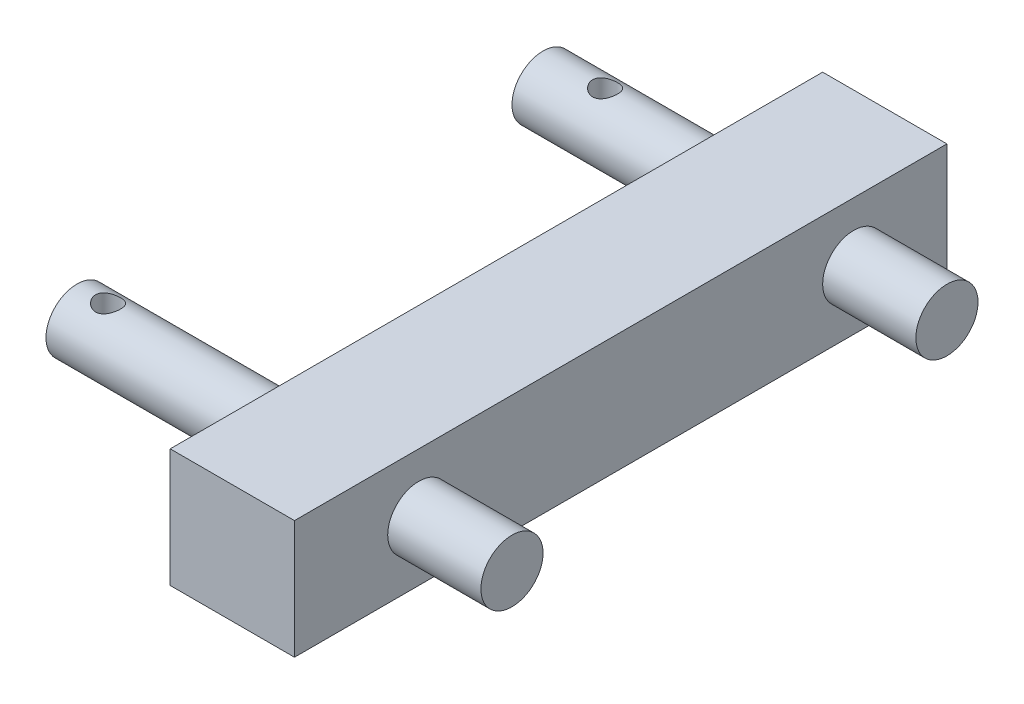
ISO-10303-21;
HEADER;
FILE_DESCRIPTION(('STEP AP214'),'2;1');
FILE_NAME('part.step','',(''),(''),'','','');
FILE_SCHEMA(('AUTOMOTIVE_DESIGN { 1 0 10303 214 1 1 1 1 }'));
ENDSEC;
DATA;
#1=APPLICATION_CONTEXT('core data for automotive mechanical design processes');
#2=APPLICATION_PROTOCOL_DEFINITION('international standard','automotive_design',2000,#1);
#3=PRODUCT_CONTEXT('',#1,'mechanical');
#4=PRODUCT('Part','Part','',(#3));
#5=PRODUCT_RELATED_PRODUCT_CATEGORY('part','',(#4));
#6=PRODUCT_DEFINITION_FORMATION('','',#4);
#7=PRODUCT_DEFINITION_CONTEXT('part definition',#1,'design');
#8=PRODUCT_DEFINITION('design','',#6,#7);
#9=PRODUCT_DEFINITION_SHAPE('','',#8);
#10=(LENGTH_UNIT() NAMED_UNIT(*) SI_UNIT(.MILLI.,.METRE.));
#11=(NAMED_UNIT(*) PLANE_ANGLE_UNIT() SI_UNIT($,.RADIAN.));
#12=(NAMED_UNIT(*) SI_UNIT($,.STERADIAN.) SOLID_ANGLE_UNIT());
#13=UNCERTAINTY_MEASURE_WITH_UNIT(LENGTH_MEASURE(1.E-05),#10,'distance_accuracy_value','');
#14=(GEOMETRIC_REPRESENTATION_CONTEXT(3) GLOBAL_UNCERTAINTY_ASSIGNED_CONTEXT((#13)) GLOBAL_UNIT_ASSIGNED_CONTEXT((#10,
#11,#12)) REPRESENTATION_CONTEXT('',''));
#15=CARTESIAN_POINT('',(0.,0.,0.));
#16=DIRECTION('',(0.,0.,1.));
#17=DIRECTION('',(1.,0.,0.));
#18=AXIS2_PLACEMENT_3D('',#15,#16,#17);
#19=CARTESIAN_POINT('',(-60.,75.8275362318841,-30.));
#20=DIRECTION('',(1.,0.,0.));
#21=DIRECTION('',(0.,0.,-1.));
#22=AXIS2_PLACEMENT_3D('',#19,#20,#21);
#23=CYLINDRICAL_SURFACE('',#22,9.99999999999995);
#24=CARTESIAN_POINT('',(-40.,66.6623848419724,-34.));
#25=CARTESIAN_POINT('',(-39.8928225032156,66.6623840246591,-33.9999991799669));
#26=CARTESIAN_POINT('',(-39.7856121402052,66.6604984048382,-33.9956862757883));
#27=CARTESIAN_POINT('',(-39.5719679058293,66.6530173260714,-33.9784780450432));
#28=CARTESIAN_POINT('',(-39.4655345500547,66.6474195964997,-33.965577465543));
#29=CARTESIAN_POINT('',(-39.2540640466445,66.6326854457234,-33.9312935770878));
#30=CARTESIAN_POINT('',(-39.1490301151513,66.6235419734008,-33.9098933635657));
#31=CARTESIAN_POINT('',(-38.9413124028102,66.6020217699015,-33.8588393720858));
#32=CARTESIAN_POINT('',(-38.8386296168982,66.589643696467,-33.8291821674013));
#33=CARTESIAN_POINT('',(-38.5360102733714,66.5483339170078,-33.7284997845045));
#34=CARTESIAN_POINT('',(-38.3404620790357,66.5151481299489,-33.6455922809956));
#35=CARTESIAN_POINT('',(-37.966198731327,66.4412411051698,-33.4508325645389));
#36=CARTESIAN_POINT('',(-37.7874799141088,66.4005215133488,-33.3389866715961));
#37=CARTESIAN_POINT('',(-37.4414881863986,66.3135194572749,-33.082646249532));
#38=CARTESIAN_POINT('',(-37.275289566711,66.2670580139639,-32.9367593327215));
#39=CARTESIAN_POINT('',(-36.9689395919581,66.1752869510039,-32.6194175940661));
#40=CARTESIAN_POINT('',(-36.828797339245,66.1299777386209,-32.4479538749543));
#41=CARTESIAN_POINT('',(-36.5731878901629,66.0434681138024,-32.0760127957501));
#42=CARTESIAN_POINT('',(-36.4589115800306,66.0025001689256,-31.8746579780387));
#43=CARTESIAN_POINT('',(-36.266312680323,65.9314576685446,-31.4536505989552));
#44=CARTESIAN_POINT('',(-36.1879754605667,65.9013786813879,-31.2340055263283));
#45=CARTESIAN_POINT('',(-36.073317072677,65.8567697343855,-30.7939328653324));
#46=CARTESIAN_POINT('',(-36.0351453840019,65.8415574970902,-30.5740579727255));
#47=CARTESIAN_POINT('',(-35.9959430164992,65.8259300175171,-30.1305326541602));
#48=CARTESIAN_POINT('',(-35.9948984849555,65.8255092563117,-29.9068836675369));
#49=CARTESIAN_POINT('',(-36.0289655425464,65.839096975624,-29.4755350113361));
#50=CARTESIAN_POINT('',(-36.0620495462971,65.8522962964952,-29.2676450944575));
#51=CARTESIAN_POINT('',(-36.1599857518182,65.8905504024605,-28.8606537813577));
#52=CARTESIAN_POINT('',(-36.2248402845843,65.9156060574463,-28.661553031164));
#53=CARTESIAN_POINT('',(-36.3852729659723,65.9755997427459,-28.2742041230333));
#54=CARTESIAN_POINT('',(-36.4812994296887,66.0106810225626,-28.0861647532568));
#55=CARTESIAN_POINT('',(-36.7009300137803,66.0872445282756,-27.7283836985028));
#56=CARTESIAN_POINT('',(-36.8245435861843,66.1287289465403,-27.55864831456));
#57=CARTESIAN_POINT('',(-37.1052982719048,66.2171034883625,-27.2304623440239));
#58=CARTESIAN_POINT('',(-37.2641077851502,66.2641697016492,-27.0734843094685));
#59=CARTESIAN_POINT('',(-37.6059811436594,66.3563030124186,-26.7877851692135));
#60=CARTESIAN_POINT('',(-37.78905289639,66.4013694517225,-26.6590733124257));
#61=CARTESIAN_POINT('',(-38.1808380447491,66.4855982837037,-26.4301916225618));
#62=CARTESIAN_POINT('',(-38.3901296606776,66.52455795073,-26.3309306967276));
#63=CARTESIAN_POINT('',(-38.8244309806241,66.5897844250024,-26.169647480267));
#64=CARTESIAN_POINT('',(-39.0494303694531,66.6160594740579,-26.107601003244));
#65=CARTESIAN_POINT('',(-39.4940715549349,66.6509410378298,-26.0260901022902));
#66=CARTESIAN_POINT('',(-39.7132008942571,66.6605289027613,-26.0042558063709));
#67=CARTESIAN_POINT('',(-40.1521544155191,66.6637462745034,-25.9968773471142));
#68=CARTESIAN_POINT('',(-40.3719783665513,66.6573806206769,-26.0113221788174));
#69=CARTESIAN_POINT('',(-40.7929178699139,66.6304153447018,-26.0739342104199));
#70=CARTESIAN_POINT('',(-40.9943858748,66.6106470759181,-26.1201338759523));
#71=CARTESIAN_POINT('',(-41.386576809571,66.5601352113373,-26.2423916261782));
#72=CARTESIAN_POINT('',(-41.5772973462148,66.5293891821122,-26.3184563313954));
#73=CARTESIAN_POINT('',(-41.9512047155908,66.4588605946821,-26.5017287210369));
#74=CARTESIAN_POINT('',(-42.1337723773872,66.4187621391005,-26.6100742634708));
#75=CARTESIAN_POINT('',(-42.478965974885,66.3345285287282,-26.8536695511162));
#76=CARTESIAN_POINT('',(-42.6415837455978,66.2903917339633,-26.9889302530356));
#77=CARTESIAN_POINT('',(-42.9547468171913,66.1991179124557,-27.2943115766394));
#78=CARTESIAN_POINT('',(-43.1035131305545,66.1520000861791,-27.4662691411114));
#79=CARTESIAN_POINT('',(-43.3703541532482,66.0631403405339,-27.8338327332606));
#80=CARTESIAN_POINT('',(-43.4884276132975,66.0213986400229,-28.0294397230581));
#81=CARTESIAN_POINT('',(-43.6900952528195,65.9478619138748,-28.4394401320027));
#82=CARTESIAN_POINT('',(-43.7736976879472,65.9160645070653,-28.653829038035));
#83=CARTESIAN_POINT('',(-43.9030977051994,65.8660819625116,-29.0952128181384));
#84=CARTESIAN_POINT('',(-43.9489158043134,65.8478894377829,-29.3222007793252));
#85=CARTESIAN_POINT('',(-43.999009401911,65.8279560676274,-29.766366979388));
#86=CARTESIAN_POINT('',(-44.0058002520768,65.8252192968186,-29.9832190151057));
#87=CARTESIAN_POINT('',(-43.9842890462796,65.8338153844803,-30.4148676711747));
#88=CARTESIAN_POINT('',(-43.9559923024791,65.8451461131716,-30.6296645977029));
#89=CARTESIAN_POINT('',(-43.8669064057872,65.8801059639925,-31.0443418049458));
#90=CARTESIAN_POINT('',(-43.807142043495,65.9033466169667,-31.2444776131699));
#91=CARTESIAN_POINT('',(-43.6578944552422,65.9596372774745,-31.631844705644));
#92=CARTESIAN_POINT('',(-43.568405747944,65.9926890941227,-31.8190736020911));
#93=CARTESIAN_POINT('',(-43.3577933524316,66.0671743359965,-32.1844060987939));
#94=CARTESIAN_POINT('',(-43.2354464559039,66.1089136042386,-32.3617408310488));
#95=CARTESIAN_POINT('',(-42.9644239163639,66.1957482012498,-32.6941079995884));
#96=CARTESIAN_POINT('',(-42.8157373759609,66.2408449145864,-32.849131156699));
#97=CARTESIAN_POINT('',(-42.4853657611342,66.3327808293249,-33.1424027582614));
#98=CARTESIAN_POINT('',(-42.302207701298,66.379555075347,-33.2790186502017));
#99=CARTESIAN_POINT('',(-41.9141302787523,66.4665433068692,-33.5196940249722));
#100=CARTESIAN_POINT('',(-41.7092083613338,66.5067565208067,-33.6237496801108));
#101=CARTESIAN_POINT('',(-41.3018760562205,66.5723572254604,-33.7879851569083));
#102=CARTESIAN_POINT('',(-41.1008923240542,66.5987517169381,-33.8512656934687));
#103=CARTESIAN_POINT('',(-40.7933610402093,66.6286805734502,-33.9219463210498));
#104=CARTESIAN_POINT('',(-40.6899269641056,66.6370435255464,-33.9414605214492));
#105=CARTESIAN_POINT('',(-40.4816430703891,66.650324228468,-33.9722885067968));
#106=CARTESIAN_POINT('',(-40.3767941106041,66.6552439789524,-33.9836070515516));
#107=CARTESIAN_POINT('',(-40.2264494086476,66.65969947765,-33.9938423210329));
#108=CARTESIAN_POINT('',(-40.1812001696778,66.66070563373,-33.9961505841499));
#109=CARTESIAN_POINT('',(-40.0906359157854,66.6620485132363,-33.9992296533752));
#110=CARTESIAN_POINT('',(-40.0453208962838,66.6623851875802,-34.0000003467579));
#111=CARTESIAN_POINT('',(-40.,66.6623848419724,-34.));
#112=B_SPLINE_CURVE_WITH_KNOTS('',3,(#24,#25,#26,#27,#28,#29,#30,#31,#32,#33,#34,#35,#36,#37,
#38,#39,#40,#41,#42,#43,#44,#45,#46,#47,#48,#49,#50,#51,#52,#53,#54,#55,#56,#57,#58,#59,#60,#61,
#62,#63,#64,#65,#66,#67,#68,#69,#70,#71,#72,#73,#74,#75,#76,#77,#78,#79,#80,#81,#82,#83,#84,#85,
#86,#87,#88,#89,#90,#91,#92,#93,#94,#95,#96,#97,#98,#99,#100,#101,#102,#103,#104,#105,#106,#107,
#108,#109,#110,#111),.UNSPECIFIED.,.T.,.F.,(4,2,2,2,2,2,2,2,2,2,2,2,2,2,2,2,2,2,2,2,2,2,2,2,2,2,
2,2,2,2,2,2,2,2,2,2,2,2,2,2,2,2,2,4),(0.,0.321486083338399,0.643168995111199,0.96549491827271,
1.28795480954363,1.92974178448592,2.57138871437637,3.24631250358765,3.921471624866,
4.62325351972773,5.32474947728876,5.99228379564283,6.6595690440126,7.28937303450521,
7.91922324048035,8.55856614259712,9.19812843669979,9.87968101952628,10.5614562804417,
11.2624893122443,11.9630662339012,12.6208430883876,13.278420436058,13.8985450996021,
14.5188073109319,15.1642232309532,15.8099024284162,16.5032748228388,17.1966754349541,
17.8899098841554,18.5827676569819,19.2304209330182,19.8779761681512,20.5056400267662,
21.1334196944709,21.7889411606977,22.4447344691833,23.1411252036115,23.837597773083,
24.4715333542807,24.7879924179097,25.104267543275,25.2402006430821,25.3761437083412),.UNSPECIFIED.);
#113=CARTESIAN_POINT('',(-40.,66.6623848419724,-34.));
#114=VERTEX_POINT('',#113);
#115=EDGE_CURVE('E360',#114,#114,#112,.T.);
#116=ORIENTED_EDGE('',*,*,#115,.F.);
#117=EDGE_LOOP('',(#116));
#118=FACE_BOUND('',#117,.T.);
#119=CARTESIAN_POINT('',(0.,75.8275362318841,-30.));
#120=DIRECTION('',(-1.,0.,0.));
#121=DIRECTION('',(0.,0.,1.));
#122=AXIS2_PLACEMENT_3D('',#119,#120,#121);
#123=CIRCLE('',#122,9.99999999999995);
#124=CARTESIAN_POINT('',(0.,75.8275362318841,-20.0000000000001));
#125=VERTEX_POINT('',#124);
#126=EDGE_CURVE('E11',#125,#125,#123,.T.);
#127=ORIENTED_EDGE('',*,*,#126,.T.);
#128=EDGE_LOOP('',(#127));
#129=FACE_BOUND('',#128,.T.);
#130=CARTESIAN_POINT('',(-60.,75.8275362318841,-30.));
#131=DIRECTION('',(1.,0.,0.));
#132=DIRECTION('',(0.,0.,-1.));
#133=AXIS2_PLACEMENT_3D('',#130,#131,#132);
#134=CIRCLE('',#133,9.99999999999995);
#135=CARTESIAN_POINT('',(-60.,75.8275362318841,-39.9999999999999));
#136=VERTEX_POINT('',#135);
#137=EDGE_CURVE('E177',#136,#136,#134,.T.);
#138=ORIENTED_EDGE('',*,*,#137,.T.);
#139=EDGE_LOOP('',(#138));
#140=FACE_BOUND('',#139,.T.);
#141=CARTESIAN_POINT('',(-40.,84.9926876217957,-34.));
#142=CARTESIAN_POINT('',(-40.1071774967844,84.992688439109,-33.9999991799669));
#143=CARTESIAN_POINT('',(-40.2143878597948,84.9945740589299,-33.9956862757883));
#144=CARTESIAN_POINT('',(-40.4280320941707,85.0020551376967,-33.9784780450432));
#145=CARTESIAN_POINT('',(-40.5344654499453,85.0076528672684,-33.965577465543));
#146=CARTESIAN_POINT('',(-40.7459359533555,85.0223870180447,-33.9312935770878));
#147=CARTESIAN_POINT('',(-40.8509698848487,85.0315304903673,-33.9098933635657));
#148=CARTESIAN_POINT('',(-41.0586875971898,85.0530506938666,-33.8588393720858));
#149=CARTESIAN_POINT('',(-41.1613703831018,85.0654287673011,-33.8291821674013));
#150=CARTESIAN_POINT('',(-41.4639897266286,85.1067385467603,-33.7284997845045));
#151=CARTESIAN_POINT('',(-41.6595379209643,85.1399243338192,-33.6455922809956));
#152=CARTESIAN_POINT('',(-42.033801268673,85.2138313585984,-33.4508325645389));
#153=CARTESIAN_POINT('',(-42.2125200858912,85.2545509504193,-33.3389866715961));
#154=CARTESIAN_POINT('',(-42.5585118136014,85.3415530064933,-33.082646249532));
#155=CARTESIAN_POINT('',(-42.724710433289,85.3880144498042,-32.9367593327215));
#156=CARTESIAN_POINT('',(-43.0310604080419,85.4797855127642,-32.6194175940661));
#157=CARTESIAN_POINT('',(-43.171202660755,85.5250947251473,-32.4479538749543));
#158=CARTESIAN_POINT('',(-43.4268121098371,85.6116043499657,-32.0760127957501));
#159=CARTESIAN_POINT('',(-43.5410884199694,85.6525722948425,-31.8746579780387));
#160=CARTESIAN_POINT('',(-43.733687319677,85.7236147952235,-31.4536505989552));
#161=CARTESIAN_POINT('',(-43.8120245394333,85.7536937823802,-31.2340055263283));
#162=CARTESIAN_POINT('',(-43.926682927323,85.7983027293826,-30.7939328653324));
#163=CARTESIAN_POINT('',(-43.9648546159981,85.8135149666779,-30.5740579727255));
#164=CARTESIAN_POINT('',(-44.0040569835008,85.829142446251,-30.1305326541602));
#165=CARTESIAN_POINT('',(-44.0051015150445,85.8295632074564,-29.9068836675369));
#166=CARTESIAN_POINT('',(-43.9710344574536,85.8159754881441,-29.4755350113361));
#167=CARTESIAN_POINT('',(-43.9379504537029,85.8027761672729,-29.2676450944575));
#168=CARTESIAN_POINT('',(-43.8400142481818,85.7645220613076,-28.8606537813577));
#169=CARTESIAN_POINT('',(-43.7751597154157,85.7394664063218,-28.661553031164));
#170=CARTESIAN_POINT('',(-43.6147270340277,85.6794727210222,-28.2742041230333));
#171=CARTESIAN_POINT('',(-43.5187005703113,85.6443914412055,-28.0861647532568));
#172=CARTESIAN_POINT('',(-43.2990699862197,85.5678279354925,-27.7283836985028));
#173=CARTESIAN_POINT('',(-43.1754564138157,85.5263435172278,-27.55864831456));
#174=CARTESIAN_POINT('',(-42.8947017280952,85.4379689754056,-27.2304623440239));
#175=CARTESIAN_POINT('',(-42.7358922148498,85.3909027621189,-27.0734843094685));
#176=CARTESIAN_POINT('',(-42.3940188563406,85.2987694513495,-26.7877851692135));
#177=CARTESIAN_POINT('',(-42.2109471036101,85.2537030120456,-26.6590733124257));
#178=CARTESIAN_POINT('',(-41.8191619552509,85.1694741800644,-26.4301916225618));
#179=CARTESIAN_POINT('',(-41.6098703393224,85.1305145130381,-26.3309306967276));
#180=CARTESIAN_POINT('',(-41.1755690193759,85.0652880387657,-26.169647480267));
#181=CARTESIAN_POINT('',(-40.9505696305469,85.0390129897102,-26.107601003244));
#182=CARTESIAN_POINT('',(-40.5059284450651,85.0041314259383,-26.0260901022902));
#183=CARTESIAN_POINT('',(-40.2867991057429,84.9945435610068,-26.0042558063709));
#184=CARTESIAN_POINT('',(-39.8478455844809,84.9913261892648,-25.9968773471142));
#185=CARTESIAN_POINT('',(-39.6280216334487,84.9976918430912,-26.0113221788174));
#186=CARTESIAN_POINT('',(-39.2070821300862,85.0246571190663,-26.0739342104199));
#187=CARTESIAN_POINT('',(-39.0056141252,85.04442538785,-26.1201338759523));
#188=CARTESIAN_POINT('',(-38.613423190429,85.0949372524308,-26.2423916261782));
#189=CARTESIAN_POINT('',(-38.4227026537852,85.1256832816559,-26.3184563313954));
#190=CARTESIAN_POINT('',(-38.0487952844092,85.196211869086,-26.5017287210369));
#191=CARTESIAN_POINT('',(-37.8662276226128,85.2363103246676,-26.6100742634708));
#192=CARTESIAN_POINT('',(-37.521034025115,85.3205439350399,-26.8536695511162));
#193=CARTESIAN_POINT('',(-37.3584162544022,85.3646807298048,-26.9889302530356));
#194=CARTESIAN_POINT('',(-37.0452531828087,85.4559545513124,-27.2943115766394));
#195=CARTESIAN_POINT('',(-36.8964868694455,85.5030723775891,-27.4662691411114));
#196=CARTESIAN_POINT('',(-36.6296458467518,85.5919321232342,-27.8338327332606));
#197=CARTESIAN_POINT('',(-36.5115723867025,85.6336738237452,-28.0294397230581));
#198=CARTESIAN_POINT('',(-36.3099047471805,85.7072105498933,-28.4394401320027));
#199=CARTESIAN_POINT('',(-36.2263023120528,85.7390079567028,-28.653829038035));
#200=CARTESIAN_POINT('',(-36.0969022948006,85.7889905012565,-29.0952128181384));
#201=CARTESIAN_POINT('',(-36.0510841956866,85.8071830259852,-29.3222007793252));
#202=CARTESIAN_POINT('',(-36.000990598089,85.8271163961407,-29.766366979388));
#203=CARTESIAN_POINT('',(-35.9941997479232,85.8298531669495,-29.9832190151057));
#204=CARTESIAN_POINT('',(-36.0157109537204,85.8212570792878,-30.4148676711747));
#205=CARTESIAN_POINT('',(-36.0440076975209,85.8099263505965,-30.6296645977029));
#206=CARTESIAN_POINT('',(-36.1330935942128,85.7749664997756,-31.0443418049458));
#207=CARTESIAN_POINT('',(-36.192857956505,85.7517258468014,-31.2444776131699));
#208=CARTESIAN_POINT('',(-36.3421055447578,85.6954351862936,-31.631844705644));
#209=CARTESIAN_POINT('',(-36.431594252056,85.6623833696454,-31.8190736020911));
#210=CARTESIAN_POINT('',(-36.6422066475684,85.5878981277716,-32.1844060987939));
#211=CARTESIAN_POINT('',(-36.7645535440961,85.5461588595295,-32.3617408310488));
#212=CARTESIAN_POINT('',(-37.0355760836361,85.4593242625183,-32.6941079995884));
#213=CARTESIAN_POINT('',(-37.1842626240391,85.4142275491817,-32.849131156699));
#214=CARTESIAN_POINT('',(-37.5146342388658,85.3222916344432,-33.1424027582614));
#215=CARTESIAN_POINT('',(-37.697792298702,85.2755173884211,-33.2790186502017));
#216=CARTESIAN_POINT('',(-38.0858697212476,85.1885291568989,-33.5196940249722));
#217=CARTESIAN_POINT('',(-38.2907916386662,85.1483159429614,-33.6237496801108));
#218=CARTESIAN_POINT('',(-38.6981239437795,85.0827152383077,-33.7879851569083));
#219=CARTESIAN_POINT('',(-38.8991076759458,85.05632074683,-33.8512656934687));
#220=CARTESIAN_POINT('',(-39.2066389597907,85.0263918903179,-33.9219463210498));
#221=CARTESIAN_POINT('',(-39.3100730358944,85.0180289382217,-33.9414605214492));
#222=CARTESIAN_POINT('',(-39.5183569296109,85.0047482353001,-33.9722885067968));
#223=CARTESIAN_POINT('',(-39.6232058893959,84.9998284848157,-33.9836070515516));
#224=CARTESIAN_POINT('',(-39.7735505913524,84.9953729861182,-33.9938423210329));
#225=CARTESIAN_POINT('',(-39.8187998303222,84.9943668300381,-33.9961505841499));
#226=CARTESIAN_POINT('',(-39.9093640842146,84.9930239505318,-33.9992296533752));
#227=CARTESIAN_POINT('',(-39.9546791037162,84.9926872761879,-34.0000003467579));
#228=CARTESIAN_POINT('',(-40.,84.9926876217957,-34.));
#229=B_SPLINE_CURVE_WITH_KNOTS('',3,(#141,#142,#143,#144,#145,#146,#147,#148,#149,#150,#151,
#152,#153,#154,#155,#156,#157,#158,#159,#160,#161,#162,#163,#164,#165,#166,#167,#168,#169,#170,
#171,#172,#173,#174,#175,#176,#177,#178,#179,#180,#181,#182,#183,#184,#185,#186,#187,#188,#189,
#190,#191,#192,#193,#194,#195,#196,#197,#198,#199,#200,#201,#202,#203,#204,#205,#206,#207,#208,
#209,#210,#211,#212,#213,#214,#215,#216,#217,#218,#219,#220,#221,#222,#223,#224,#225,#226,#227,
#228),.UNSPECIFIED.,.T.,.F.,(4,2,2,2,2,2,2,2,2,2,2,2,2,2,2,2,2,2,2,2,2,2,2,2,2,2,2,2,2,2,2,2,2,
2,2,2,2,2,2,2,2,2,2,4),(0.,0.321486083338407,0.643168995111198,0.965494918272709,
1.28795480954363,1.92974178448592,2.57138871437637,3.24631250358765,3.921471624866,
4.62325351972773,5.32474947728876,5.99228379564283,6.6595690440126,7.28937303450521,
7.91922324048035,8.55856614259713,9.19812843669979,9.87968101952627,10.5614562804417,
11.2624893122443,11.9630662339012,12.6208430883876,13.278420436058,13.8985450996021,
14.5188073109319,15.1642232309532,15.8099024284162,16.5032748228388,17.1966754349541,
17.8899098841554,18.5827676569819,19.2304209330183,19.8779761681512,20.5056400267662,
21.1334196944709,21.7889411606977,22.4447344691833,23.1411252036115,23.837597773083,
24.4715333542807,24.7879924179097,25.104267543275,25.2402006430821,25.3761437083412),.UNSPECIFIED.);
#230=CARTESIAN_POINT('',(-40.,84.9926876217957,-34.));
#231=VERTEX_POINT('',#230);
#232=EDGE_CURVE('E365',#231,#231,#229,.T.);
#233=ORIENTED_EDGE('',*,*,#232,.F.);
#234=EDGE_LOOP('',(#233));
#235=FACE_BOUND('',#234,.T.);
#236=ADVANCED_FACE('F41',(#118,#129,#140,#235),#23,.T.);
#237=CARTESIAN_POINT('',(-70.,75.8775362318841,110.));
#238=DIRECTION('',(1.,0.,0.));
#239=DIRECTION('',(0.,0.,-1.));
#240=AXIS2_PLACEMENT_3D('',#237,#238,#239);
#241=CYLINDRICAL_SURFACE('',#240,9.99999999999999);
#242=CARTESIAN_POINT('',(-60.,66.7123848419724,106.));
#243=CARTESIAN_POINT('',(-59.8928225032156,66.712384024659,106.000000820033));
#244=CARTESIAN_POINT('',(-59.7856121402052,66.7104984048382,106.004313724212));
#245=CARTESIAN_POINT('',(-59.5719679058293,66.7030173260714,106.021521954957));
#246=CARTESIAN_POINT('',(-59.4655345500547,66.6974195964996,106.034422534457));
#247=CARTESIAN_POINT('',(-59.2540640466445,66.6826854457233,106.068706422912));
#248=CARTESIAN_POINT('',(-59.1490301151513,66.6735419734008,106.090106636434));
#249=CARTESIAN_POINT('',(-58.9413124028102,66.6520217699015,106.141160627914));
#250=CARTESIAN_POINT('',(-58.8386296168982,66.6396436964669,106.170817832599));
#251=CARTESIAN_POINT('',(-58.5360102733714,66.5983339170077,106.271500215496));
#252=CARTESIAN_POINT('',(-58.3404620790357,66.5651481299488,106.354407719004));
#253=CARTESIAN_POINT('',(-57.966198731327,66.4912411051697,106.549167435461));
#254=CARTESIAN_POINT('',(-57.7874799141088,66.4505215133487,106.661013328404));
#255=CARTESIAN_POINT('',(-57.4414881863986,66.3635194572748,106.917353750468));
#256=CARTESIAN_POINT('',(-57.275289566711,66.3170580139639,107.063240667279));
#257=CARTESIAN_POINT('',(-56.9689395919581,66.2252869510039,107.380582405934));
#258=CARTESIAN_POINT('',(-56.828797339245,66.1799777386208,107.552046125046));
#259=CARTESIAN_POINT('',(-56.5731878901629,66.0934681138023,107.92398720425));
#260=CARTESIAN_POINT('',(-56.4589115800306,66.0525001689256,108.125342021961));
#261=CARTESIAN_POINT('',(-56.266312680323,65.9814576685446,108.546349401045));
#262=CARTESIAN_POINT('',(-56.1879754605667,65.9513786813879,108.765994473672));
#263=CARTESIAN_POINT('',(-56.073317072677,65.9067697343854,109.206067134668));
#264=CARTESIAN_POINT('',(-56.0351453840019,65.8915574970901,109.425942027274));
#265=CARTESIAN_POINT('',(-55.9959430164992,65.8759300175171,109.86946734584));
#266=CARTESIAN_POINT('',(-55.9948984849555,65.8755092563117,110.093116332463));
#267=CARTESIAN_POINT('',(-56.0289655425464,65.889096975624,110.524464988664));
#268=CARTESIAN_POINT('',(-56.0620495462971,65.9022962964952,110.732354905542));
#269=CARTESIAN_POINT('',(-56.1599857518182,65.9405504024604,111.139346218642));
#270=CARTESIAN_POINT('',(-56.2248402845843,65.9656060574462,111.338446968836));
#271=CARTESIAN_POINT('',(-56.3852729659723,66.0255997427459,111.725795876967));
#272=CARTESIAN_POINT('',(-56.4812994296887,66.0606810225626,111.913835246743));
#273=CARTESIAN_POINT('',(-56.7009300137803,66.1372445282756,112.271616301497));
#274=CARTESIAN_POINT('',(-56.8245435861843,66.1787289465403,112.44135168544));
#275=CARTESIAN_POINT('',(-57.1052982719048,66.2671034883625,112.769537655976));
#276=CARTESIAN_POINT('',(-57.2641077851502,66.3141697016491,112.926515690531));
#277=CARTESIAN_POINT('',(-57.6059811436594,66.4063030124186,113.212214830786));
#278=CARTESIAN_POINT('',(-57.78905289639,66.4513694517225,113.340926687574));
#279=CARTESIAN_POINT('',(-58.1808380447491,66.5355982837037,113.569808377438));
#280=CARTESIAN_POINT('',(-58.3901296606776,66.5745579507299,113.669069303272));
#281=CARTESIAN_POINT('',(-58.8244309806241,66.6397844250024,113.830352519733));
#282=CARTESIAN_POINT('',(-59.0494303694531,66.6660594740579,113.892398996756));
#283=CARTESIAN_POINT('',(-59.494071554935,66.7009410378298,113.97390989771));
#284=CARTESIAN_POINT('',(-59.7132008942571,66.7105289027613,113.995744193629));
#285=CARTESIAN_POINT('',(-60.1521544155191,66.7137462745033,114.003122652886));
#286=CARTESIAN_POINT('',(-60.3719783665513,66.7073806206768,113.988677821183));
#287=CARTESIAN_POINT('',(-60.7929178699139,66.6804153447018,113.92606578958));
#288=CARTESIAN_POINT('',(-60.9943858748,66.660647075918,113.879866124048));
#289=CARTESIAN_POINT('',(-61.386576809571,66.6101352113373,113.757608373822));
#290=CARTESIAN_POINT('',(-61.5772973462148,66.5793891821121,113.681543668605));
#291=CARTESIAN_POINT('',(-61.9512047155908,66.508860594682,113.498271278963));
#292=CARTESIAN_POINT('',(-62.1337723773872,66.4687621391005,113.389925736529));
#293=CARTESIAN_POINT('',(-62.478965974885,66.3845285287282,113.146330448884));
#294=CARTESIAN_POINT('',(-62.6415837455978,66.3403917339633,113.011069746964));
#295=CARTESIAN_POINT('',(-62.9547468171913,66.2491179124556,112.705688423361));
#296=CARTESIAN_POINT('',(-63.1035131305545,66.202000086179,112.533730858889));
#297=CARTESIAN_POINT('',(-63.3703541532482,66.1131403405338,112.166167266739));
#298=CARTESIAN_POINT('',(-63.4884276132975,66.0713986400229,111.970560276942));
#299=CARTESIAN_POINT('',(-63.6900952528195,65.9978619138748,111.560559867997));
#300=CARTESIAN_POINT('',(-63.7736976879472,65.9660645070653,111.346170961965));
#301=CARTESIAN_POINT('',(-63.9030977051994,65.9160819625116,110.904787181862));
#302=CARTESIAN_POINT('',(-63.9489158043134,65.8978894377829,110.677799220675));
#303=CARTESIAN_POINT('',(-63.999009401911,65.8779560676274,110.233633020612));
#304=CARTESIAN_POINT('',(-64.0058002520768,65.8752192968185,110.016780984894));
#305=CARTESIAN_POINT('',(-63.9842890462796,65.8838153844803,109.585132328825));
#306=CARTESIAN_POINT('',(-63.9559923024791,65.8951461131715,109.370335402297));
#307=CARTESIAN_POINT('',(-63.8669064057872,65.9301059639925,108.955658195054));
#308=CARTESIAN_POINT('',(-63.807142043495,65.9533466169667,108.75552238683));
#309=CARTESIAN_POINT('',(-63.6578944552422,66.0096372774745,108.368155294356));
#310=CARTESIAN_POINT('',(-63.568405747944,66.0426890941227,108.180926397909));
#311=CARTESIAN_POINT('',(-63.3577933524316,66.1171743359964,107.815593901206));
#312=CARTESIAN_POINT('',(-63.2354464559039,66.1589136042386,107.638259168951));
#313=CARTESIAN_POINT('',(-62.9644239163639,66.2457482012498,107.305892000412));
#314=CARTESIAN_POINT('',(-62.8157373759609,66.2908449145863,107.150868843301));
#315=CARTESIAN_POINT('',(-62.4853657611342,66.3827808293248,106.857597241739));
#316=CARTESIAN_POINT('',(-62.302207701298,66.429555075347,106.720981349798));
#317=CARTESIAN_POINT('',(-61.9141302787523,66.5165433068692,106.480305975028));
#318=CARTESIAN_POINT('',(-61.7092083613338,66.5567565208067,106.376250319889));
#319=CARTESIAN_POINT('',(-61.3018760562204,66.6223572254604,106.212014843092));
#320=CARTESIAN_POINT('',(-61.1008923240541,66.648751716938,106.148734306531));
#321=CARTESIAN_POINT('',(-60.7933610402093,66.6786805734502,106.07805367895));
#322=CARTESIAN_POINT('',(-60.6899269641056,66.6870435255464,106.058539478551));
#323=CARTESIAN_POINT('',(-60.4816430703891,66.700324228468,106.027711493203));
#324=CARTESIAN_POINT('',(-60.3767941106041,66.7052439789524,106.016392948448));
#325=CARTESIAN_POINT('',(-60.2264494086476,66.7096994776499,106.006157678967));
#326=CARTESIAN_POINT('',(-60.1812001696778,66.7107056337299,106.00384941585));
#327=CARTESIAN_POINT('',(-60.0906359157854,66.7120485132363,106.000770346625));
#328=CARTESIAN_POINT('',(-60.0453208962838,66.7123851875802,105.999999653242));
#329=CARTESIAN_POINT('',(-60.,66.7123848419724,106.));
#330=B_SPLINE_CURVE_WITH_KNOTS('',3,(#242,#243,#244,#245,#246,#247,#248,#249,#250,#251,#252,
#253,#254,#255,#256,#257,#258,#259,#260,#261,#262,#263,#264,#265,#266,#267,#268,#269,#270,#271,
#272,#273,#274,#275,#276,#277,#278,#279,#280,#281,#282,#283,#284,#285,#286,#287,#288,#289,#290,
#291,#292,#293,#294,#295,#296,#297,#298,#299,#300,#301,#302,#303,#304,#305,#306,#307,#308,#309,
#310,#311,#312,#313,#314,#315,#316,#317,#318,#319,#320,#321,#322,#323,#324,#325,#326,#327,#328,
#329),.UNSPECIFIED.,.T.,.F.,(4,2,2,2,2,2,2,2,2,2,2,2,2,2,2,2,2,2,2,2,2,2,2,2,2,2,2,2,2,2,2,2,2,
2,2,2,2,2,2,2,2,2,2,4),(0.,0.321486083338406,0.643168995111192,0.965494918272708,
1.28795480954364,1.92974178448593,2.57138871437638,3.24631250358765,3.92147162486602,
4.62325351972772,5.32474947728876,5.99228379564282,6.65956904401261,7.28937303450521,
7.91922324048035,8.55856614259713,9.1981284366998,9.87968101952628,10.5614562804417,
11.2624893122443,11.9630662339012,12.6208430883876,13.278420436058,13.8985450996021,
14.5188073109319,15.1642232309532,15.8099024284162,16.5032748228388,17.1966754349542,
17.8899098841554,18.5827676569819,19.2304209330183,19.8779761681512,20.5056400267662,
21.1334196944709,21.7889411606977,22.4447344691833,23.1411252036115,23.837597773083,
24.4715333542807,24.7879924179097,25.104267543275,25.2402006430821,25.3761437083412),.UNSPECIFIED.);
#331=CARTESIAN_POINT('',(-60.,66.7123848419724,106.));
#332=VERTEX_POINT('',#331);
#333=EDGE_CURVE('E176',#332,#332,#330,.T.);
#334=ORIENTED_EDGE('',*,*,#333,.F.);
#335=EDGE_LOOP('',(#334));
#336=FACE_BOUND('',#335,.T.);
#337=CARTESIAN_POINT('',(0.,75.8775362318841,110.));
#338=DIRECTION('',(-1.,0.,0.));
#339=DIRECTION('',(0.,0.,1.));
#340=AXIS2_PLACEMENT_3D('',#337,#338,#339);
#341=CIRCLE('',#340,9.99999999999999);
#342=CARTESIAN_POINT('',(0.,75.8775362318841,120.));
#343=VERTEX_POINT('',#342);
#344=EDGE_CURVE('E50',#343,#343,#341,.T.);
#345=ORIENTED_EDGE('',*,*,#344,.T.);
#346=EDGE_LOOP('',(#345));
#347=FACE_BOUND('',#346,.T.);
#348=CARTESIAN_POINT('',(-70.,75.8775362318841,110.));
#349=DIRECTION('',(1.,0.,0.));
#350=DIRECTION('',(0.,0.,-1.));
#351=AXIS2_PLACEMENT_3D('',#348,#349,#350);
#352=CIRCLE('',#351,9.99999999999999);
#353=CARTESIAN_POINT('',(-70.,75.8775362318841,100.));
#354=VERTEX_POINT('',#353);
#355=EDGE_CURVE('E214',#354,#354,#352,.T.);
#356=ORIENTED_EDGE('',*,*,#355,.T.);
#357=EDGE_LOOP('',(#356));
#358=FACE_BOUND('',#357,.T.);
#359=CARTESIAN_POINT('',(-60.,85.0426876217957,106.));
#360=CARTESIAN_POINT('',(-60.1071774967844,85.0426884391091,106.000000820033));
#361=CARTESIAN_POINT('',(-60.2143878597948,85.0445740589299,106.004313724212));
#362=CARTESIAN_POINT('',(-60.4280320941707,85.0520551376967,106.021521954957));
#363=CARTESIAN_POINT('',(-60.5344654499453,85.0576528672685,106.034422534457));
#364=CARTESIAN_POINT('',(-60.7459359533555,85.0723870180448,106.068706422912));
#365=CARTESIAN_POINT('',(-60.8509698848487,85.0815304903673,106.090106636434));
#366=CARTESIAN_POINT('',(-61.0586875971898,85.1030506938666,106.141160627914));
#367=CARTESIAN_POINT('',(-61.1613703831018,85.1154287673012,106.170817832599));
#368=CARTESIAN_POINT('',(-61.4639897266286,85.1567385467604,106.271500215496));
#369=CARTESIAN_POINT('',(-61.6595379209643,85.1899243338193,106.354407719004));
#370=CARTESIAN_POINT('',(-62.033801268673,85.2638313585984,106.549167435461));
#371=CARTESIAN_POINT('',(-62.2125200858913,85.3045509504194,106.661013328404));
#372=CARTESIAN_POINT('',(-62.5585118136014,85.3915530064933,106.917353750468));
#373=CARTESIAN_POINT('',(-62.724710433289,85.4380144498043,107.063240667279));
#374=CARTESIAN_POINT('',(-63.0310604080419,85.5297855127642,107.380582405934));
#375=CARTESIAN_POINT('',(-63.171202660755,85.5750947251473,107.552046125046));
#376=CARTESIAN_POINT('',(-63.4268121098371,85.6616043499658,107.92398720425));
#377=CARTESIAN_POINT('',(-63.5410884199694,85.7025722948425,108.125342021961));
#378=CARTESIAN_POINT('',(-63.733687319677,85.7736147952235,108.546349401045));
#379=CARTESIAN_POINT('',(-63.8120245394333,85.8036937823803,108.765994473672));
#380=CARTESIAN_POINT('',(-63.926682927323,85.8483027293827,109.206067134668));
#381=CARTESIAN_POINT('',(-63.9648546159981,85.863514966678,109.425942027274));
#382=CARTESIAN_POINT('',(-64.0040569835008,85.8791424462511,109.86946734584));
#383=CARTESIAN_POINT('',(-64.0051015150445,85.8795632074564,110.093116332463));
#384=CARTESIAN_POINT('',(-63.9710344574536,85.8659754881441,110.524464988664));
#385=CARTESIAN_POINT('',(-63.9379504537029,85.852776167273,110.732354905542));
#386=CARTESIAN_POINT('',(-63.8400142481818,85.8145220613077,111.139346218642));
#387=CARTESIAN_POINT('',(-63.7751597154157,85.7894664063219,111.338446968836));
#388=CARTESIAN_POINT('',(-63.6147270340277,85.7294727210222,111.725795876967));
#389=CARTESIAN_POINT('',(-63.5187005703113,85.6943914412055,111.913835246743));
#390=CARTESIAN_POINT('',(-63.2990699862197,85.6178279354926,112.271616301497));
#391=CARTESIAN_POINT('',(-63.1754564138157,85.5763435172279,112.44135168544));
#392=CARTESIAN_POINT('',(-62.8947017280952,85.4879689754056,112.769537655976));
#393=CARTESIAN_POINT('',(-62.7358922148498,85.440902762119,112.926515690531));
#394=CARTESIAN_POINT('',(-62.3940188563406,85.3487694513495,113.212214830786));
#395=CARTESIAN_POINT('',(-62.21094710361,85.3037030120456,113.340926687574));
#396=CARTESIAN_POINT('',(-61.8191619552508,85.2194741800645,113.569808377438));
#397=CARTESIAN_POINT('',(-61.6098703393224,85.1805145130382,113.669069303272));
#398=CARTESIAN_POINT('',(-61.1755690193759,85.1152880387658,113.830352519733));
#399=CARTESIAN_POINT('',(-60.9505696305469,85.0890129897103,113.892398996756));
#400=CARTESIAN_POINT('',(-60.505928445065,85.0541314259384,113.97390989771));
#401=CARTESIAN_POINT('',(-60.2867991057429,85.0445435610068,113.995744193629));
#402=CARTESIAN_POINT('',(-59.8478455844809,85.0413261892648,114.003122652886));
#403=CARTESIAN_POINT('',(-59.6280216334487,85.0476918430913,113.988677821183));
#404=CARTESIAN_POINT('',(-59.2070821300861,85.0746571190663,113.92606578958));
#405=CARTESIAN_POINT('',(-59.0056141252,85.0944253878501,113.879866124048));
#406=CARTESIAN_POINT('',(-58.613423190429,85.1449372524309,113.757608373822));
#407=CARTESIAN_POINT('',(-58.4227026537852,85.175683281656,113.681543668605));
#408=CARTESIAN_POINT('',(-58.0487952844092,85.2462118690861,113.498271278963));
#409=CARTESIAN_POINT('',(-57.8662276226128,85.2863103246676,113.389925736529));
#410=CARTESIAN_POINT('',(-57.521034025115,85.3705439350399,113.146330448884));
#411=CARTESIAN_POINT('',(-57.3584162544022,85.4146807298048,113.011069746964));
#412=CARTESIAN_POINT('',(-57.0452531828087,85.5059545513125,112.705688423361));
#413=CARTESIAN_POINT('',(-56.8964868694455,85.5530723775891,112.533730858889));
#414=CARTESIAN_POINT('',(-56.6296458467518,85.6419321232343,112.166167266739));
#415=CARTESIAN_POINT('',(-56.5115723867025,85.6836738237453,111.970560276942));
#416=CARTESIAN_POINT('',(-56.3099047471805,85.7572105498934,111.560559867997));
#417=CARTESIAN_POINT('',(-56.2263023120528,85.7890079567029,111.346170961965));
#418=CARTESIAN_POINT('',(-56.0969022948006,85.8389905012565,110.904787181862));
#419=CARTESIAN_POINT('',(-56.0510841956866,85.8571830259853,110.677799220675));
#420=CARTESIAN_POINT('',(-56.000990598089,85.8771163961407,110.233633020612));
#421=CARTESIAN_POINT('',(-55.9941997479232,85.8798531669496,110.016780984894));
#422=CARTESIAN_POINT('',(-56.0157109537204,85.8712570792879,109.585132328825));
#423=CARTESIAN_POINT('',(-56.0440076975209,85.8599263505966,109.370335402297));
#424=CARTESIAN_POINT('',(-56.1330935942128,85.8249664997756,108.955658195054));
#425=CARTESIAN_POINT('',(-56.192857956505,85.8017258468014,108.75552238683));
#426=CARTESIAN_POINT('',(-56.3421055447578,85.7454351862936,108.368155294356));
#427=CARTESIAN_POINT('',(-56.431594252056,85.7123833696454,108.180926397909));
#428=CARTESIAN_POINT('',(-56.6422066475684,85.6378981277717,107.815593901206));
#429=CARTESIAN_POINT('',(-56.7645535440961,85.5961588595296,107.638259168951));
#430=CARTESIAN_POINT('',(-57.0355760836361,85.5093242625184,107.305892000412));
#431=CARTESIAN_POINT('',(-57.1842626240391,85.4642275491818,107.150868843301));
#432=CARTESIAN_POINT('',(-57.5146342388658,85.3722916344433,106.857597241739));
#433=CARTESIAN_POINT('',(-57.697792298702,85.3255173884212,106.720981349798));
#434=CARTESIAN_POINT('',(-58.0858697212477,85.2385291568989,106.480305975028));
#435=CARTESIAN_POINT('',(-58.2907916386662,85.1983159429614,106.376250319889));
#436=CARTESIAN_POINT('',(-58.6981239437796,85.1327152383077,106.212014843092));
#437=CARTESIAN_POINT('',(-58.8991076759459,85.1063207468301,106.148734306531));
#438=CARTESIAN_POINT('',(-59.2066389597907,85.076391890318,106.07805367895));
#439=CARTESIAN_POINT('',(-59.3100730358944,85.0680289382217,106.058539478551));
#440=CARTESIAN_POINT('',(-59.5183569296109,85.0547482353002,106.027711493203));
#441=CARTESIAN_POINT('',(-59.6232058893959,85.0498284848158,106.016392948448));
#442=CARTESIAN_POINT('',(-59.7735505913524,85.0453729861182,106.006157678967));
#443=CARTESIAN_POINT('',(-59.8187998303222,85.0443668300382,106.00384941585));
#444=CARTESIAN_POINT('',(-59.9093640842146,85.0430239505318,106.000770346625));
#445=CARTESIAN_POINT('',(-59.9546791037162,85.042687276188,105.999999653242));
#446=CARTESIAN_POINT('',(-60.,85.0426876217957,106.));
#447=B_SPLINE_CURVE_WITH_KNOTS('',3,(#359,#360,#361,#362,#363,#364,#365,#366,#367,#368,#369,
#370,#371,#372,#373,#374,#375,#376,#377,#378,#379,#380,#381,#382,#383,#384,#385,#386,#387,#388,
#389,#390,#391,#392,#393,#394,#395,#396,#397,#398,#399,#400,#401,#402,#403,#404,#405,#406,#407,
#408,#409,#410,#411,#412,#413,#414,#415,#416,#417,#418,#419,#420,#421,#422,#423,#424,#425,#426,
#427,#428,#429,#430,#431,#432,#433,#434,#435,#436,#437,#438,#439,#440,#441,#442,#443,#444,#445,
#446),.UNSPECIFIED.,.T.,.F.,(4,2,2,2,2,2,2,2,2,2,2,2,2,2,2,2,2,2,2,2,2,2,2,2,2,2,2,2,2,2,2,2,2,
2,2,2,2,2,2,2,2,2,2,4),(0.,0.321486083338399,0.643168995111185,0.965494918272701,
1.28795480954364,1.92974178448594,2.57138871437639,3.24631250358767,3.92147162486602,
4.62325351972774,5.32474947728878,5.99228379564286,6.65956904401263,7.28937303450525,
7.91922324048036,8.55856614259713,9.1981284366998,9.87968101952629,10.5614562804417,
11.2624893122443,11.9630662339012,12.6208430883876,13.278420436058,13.8985450996021,
14.518807310932,15.1642232309532,15.8099024284162,16.5032748228388,17.1966754349542,
17.8899098841554,18.5827676569819,19.2304209330183,19.8779761681513,20.5056400267663,
21.1334196944709,21.7889411606977,22.4447344691833,23.1411252036115,23.837597773083,
24.4715333542808,24.7879924179098,25.104267543275,25.2402006430821,25.3761437083412),.UNSPECIFIED.);
#448=CARTESIAN_POINT('',(-60.,85.0426876217957,106.));
#449=VERTEX_POINT('',#448);
#450=EDGE_CURVE('E180',#449,#449,#447,.T.);
#451=ORIENTED_EDGE('',*,*,#450,.F.);
#452=EDGE_LOOP('',(#451));
#453=FACE_BOUND('',#452,.T.);
#454=ADVANCED_FACE('F121',(#336,#347,#358,#453),#241,.T.);
#455=CARTESIAN_POINT('',(40.,94.9275362318841,-60.));
#456=DIRECTION('',(0.,0.,1.));
#457=DIRECTION('',(0.,-1.,0.));
#458=AXIS2_PLACEMENT_3D('',#455,#456,#457);
#459=PLANE('',#458);
#460=DIRECTION('',(0.,1.,0.));
#461=VECTOR('',#460,1.);
#462=CARTESIAN_POINT('',(0.,94.9275362318841,-60.));
#463=LINE('',#462,#461);
#464=CARTESIAN_POINT('',(0.,56.8275362318841,-60.));
#465=VERTEX_POINT('',#464);
#466=CARTESIAN_POINT('',(0.,94.9275362318841,-60.));
#467=VERTEX_POINT('',#466);
#468=EDGE_CURVE('E109',#465,#467,#463,.T.);
#469=ORIENTED_EDGE('',*,*,#468,.T.);
#470=DIRECTION('',(-1.,0.,0.));
#471=VECTOR('',#470,1.);
#472=CARTESIAN_POINT('',(40.,94.9275362318841,-60.));
#473=LINE('',#472,#471);
#474=CARTESIAN_POINT('',(40.,94.9275362318841,-60.));
#475=VERTEX_POINT('',#474);
#476=EDGE_CURVE('E100',#475,#467,#473,.T.);
#477=ORIENTED_EDGE('',*,*,#476,.F.);
#478=DIRECTION('',(0.,1.,0.));
#479=VECTOR('',#478,1.);
#480=CARTESIAN_POINT('',(40.,94.9275362318841,-60.));
#481=LINE('',#480,#479);
#482=CARTESIAN_POINT('',(40.,56.8275362318841,-60.));
#483=VERTEX_POINT('',#482);
#484=EDGE_CURVE('E94',#483,#475,#481,.T.);
#485=ORIENTED_EDGE('',*,*,#484,.F.);
#486=DIRECTION('',(-1.,0.,0.));
#487=VECTOR('',#486,1.);
#488=CARTESIAN_POINT('',(40.,56.8275362318841,-60.));
#489=LINE('',#488,#487);
#490=EDGE_CURVE('E105',#483,#465,#489,.T.);
#491=ORIENTED_EDGE('',*,*,#490,.T.);
#492=EDGE_LOOP('',(#469,#477,#485,#491));
#493=FACE_BOUND('',#492,.T.);
#494=ADVANCED_FACE('F43',(#493),#459,.F.);
#495=CARTESIAN_POINT('',(40.,94.9275362318841,-60.));
#496=DIRECTION('',(0.,-1.,0.));
#497=DIRECTION('',(0.,0.,-1.));
#498=AXIS2_PLACEMENT_3D('',#495,#496,#497);
#499=PLANE('',#498);
#500=DIRECTION('',(0.,0.,1.));
#501=VECTOR('',#500,1.);
#502=CARTESIAN_POINT('',(0.,94.9275362318841,-60.));
#503=LINE('',#502,#501);
#504=CARTESIAN_POINT('',(0.,94.9275362318841,150.));
#505=VERTEX_POINT('',#504);
#506=EDGE_CURVE('E99',#467,#505,#503,.T.);
#507=ORIENTED_EDGE('',*,*,#506,.T.);
#508=DIRECTION('',(-1.,0.,0.));
#509=VECTOR('',#508,1.);
#510=CARTESIAN_POINT('',(40.,94.9275362318841,150.));
#511=LINE('',#510,#509);
#512=CARTESIAN_POINT('',(40.,94.9275362318841,150.));
#513=VERTEX_POINT('',#512);
#514=EDGE_CURVE('E97',#513,#505,#511,.T.);
#515=ORIENTED_EDGE('',*,*,#514,.F.);
#516=DIRECTION('',(0.,0.,1.));
#517=VECTOR('',#516,1.);
#518=CARTESIAN_POINT('',(40.,94.9275362318841,-60.));
#519=LINE('',#518,#517);
#520=EDGE_CURVE('E89',#475,#513,#519,.T.);
#521=ORIENTED_EDGE('',*,*,#520,.F.);
#522=ORIENTED_EDGE('',*,*,#476,.T.);
#523=EDGE_LOOP('',(#507,#515,#521,#522));
#524=FACE_BOUND('',#523,.T.);
#525=ADVANCED_FACE('F98',(#524),#499,.F.);
#526=CARTESIAN_POINT('',(40.,94.9275362318841,150.));
#527=DIRECTION('',(0.,0.,-1.));
#528=DIRECTION('',(-1.,0.,0.));
#529=AXIS2_PLACEMENT_3D('',#526,#527,#528);
#530=PLANE('',#529);
#531=DIRECTION('',(0.,-1.,0.));
#532=VECTOR('',#531,1.);
#533=CARTESIAN_POINT('',(0.,94.9275362318841,150.));
#534=LINE('',#533,#532);
#535=CARTESIAN_POINT('',(0.,56.8275362318841,150.));
#536=VERTEX_POINT('',#535);
#537=EDGE_CURVE('E75',#505,#536,#534,.T.);
#538=ORIENTED_EDGE('',*,*,#537,.T.);
#539=DIRECTION('',(-1.,0.,0.));
#540=VECTOR('',#539,1.);
#541=CARTESIAN_POINT('',(40.,56.8275362318841,150.));
#542=LINE('',#541,#540);
#543=CARTESIAN_POINT('',(40.,56.8275362318841,150.));
#544=VERTEX_POINT('',#543);
#545=EDGE_CURVE('E101',#544,#536,#542,.T.);
#546=ORIENTED_EDGE('',*,*,#545,.F.);
#547=DIRECTION('',(0.,-1.,0.));
#548=VECTOR('',#547,1.);
#549=CARTESIAN_POINT('',(40.,94.9275362318841,150.));
#550=LINE('',#549,#548);
#551=EDGE_CURVE('E92',#513,#544,#550,.T.);
#552=ORIENTED_EDGE('',*,*,#551,.F.);
#553=ORIENTED_EDGE('',*,*,#514,.T.);
#554=EDGE_LOOP('',(#538,#546,#552,#553));
#555=FACE_BOUND('',#554,.T.);
#556=ADVANCED_FACE('F103',(#555),#530,.F.);
#557=CARTESIAN_POINT('',(40.,56.8275362318841,-60.));
#558=DIRECTION('',(0.,1.,0.));
#559=DIRECTION('',(0.,0.,1.));
#560=AXIS2_PLACEMENT_3D('',#557,#558,#559);
#561=PLANE('',#560);
#562=DIRECTION('',(0.,0.,-1.));
#563=VECTOR('',#562,1.);
#564=CARTESIAN_POINT('',(0.,56.8275362318841,-60.));
#565=LINE('',#564,#563);
#566=EDGE_CURVE('E81',#536,#465,#565,.T.);
#567=ORIENTED_EDGE('',*,*,#566,.T.);
#568=ORIENTED_EDGE('',*,*,#490,.F.);
#569=DIRECTION('',(0.,0.,-1.));
#570=VECTOR('',#569,1.);
#571=CARTESIAN_POINT('',(40.,56.8275362318841,-60.));
#572=LINE('',#571,#570);
#573=EDGE_CURVE('E58',#544,#483,#572,.T.);
#574=ORIENTED_EDGE('',*,*,#573,.F.);
#575=ORIENTED_EDGE('',*,*,#545,.T.);
#576=EDGE_LOOP('',(#567,#568,#574,#575));
#577=FACE_BOUND('',#576,.T.);
#578=ADVANCED_FACE('F132',(#577),#561,.F.);
#579=CARTESIAN_POINT('',(40.,0.,0.));
#580=DIRECTION('',(-1.,0.,0.));
#581=DIRECTION('',(0.,0.,1.));
#582=AXIS2_PLACEMENT_3D('',#579,#580,#581);
#583=PLANE('',#582);
#584=CARTESIAN_POINT('',(40.,75.8275362318841,-30.));
#585=DIRECTION('',(-1.,0.,0.));
#586=DIRECTION('',(0.,0.,1.));
#587=AXIS2_PLACEMENT_3D('',#584,#585,#586);
#588=CIRCLE('',#587,9.99999999999995);
#589=CARTESIAN_POINT('',(40.,75.8275362318841,-20.0000000000001));
#590=VERTEX_POINT('',#589);
#591=EDGE_CURVE('E175',#590,#590,#588,.T.);
#592=ORIENTED_EDGE('',*,*,#591,.T.);
#593=EDGE_LOOP('',(#592));
#594=FACE_BOUND('',#593,.T.);
#595=CARTESIAN_POINT('',(40.,75.8775362318841,110.));
#596=DIRECTION('',(-1.,0.,0.));
#597=DIRECTION('',(0.,0.,1.));
#598=AXIS2_PLACEMENT_3D('',#595,#596,#597);
#599=CIRCLE('',#598,9.99999999999999);
#600=CARTESIAN_POINT('',(40.,75.8775362318841,120.));
#601=VERTEX_POINT('',#600);
#602=EDGE_CURVE('E112',#601,#601,#599,.T.);
#603=ORIENTED_EDGE('',*,*,#602,.T.);
#604=EDGE_LOOP('',(#603));
#605=FACE_BOUND('',#604,.T.);
#606=ORIENTED_EDGE('',*,*,#484,.T.);
#607=ORIENTED_EDGE('',*,*,#520,.T.);
#608=ORIENTED_EDGE('',*,*,#551,.T.);
#609=ORIENTED_EDGE('',*,*,#573,.T.);
#610=EDGE_LOOP('',(#606,#607,#608,#609));
#611=FACE_BOUND('',#610,.T.);
#612=ADVANCED_FACE('F90',(#594,#605,#611),#583,.F.);
#613=CARTESIAN_POINT('',(0.,0.,0.));
#614=DIRECTION('',(-1.,0.,0.));
#615=DIRECTION('',(0.,0.,1.));
#616=AXIS2_PLACEMENT_3D('',#613,#614,#615);
#617=PLANE('',#616);
#618=ORIENTED_EDGE('',*,*,#126,.F.);
#619=EDGE_LOOP('',(#618));
#620=FACE_BOUND('',#619,.T.);
#621=ORIENTED_EDGE('',*,*,#344,.F.);
#622=EDGE_LOOP('',(#621));
#623=FACE_BOUND('',#622,.T.);
#624=ORIENTED_EDGE('',*,*,#468,.F.);
#625=ORIENTED_EDGE('',*,*,#566,.F.);
#626=ORIENTED_EDGE('',*,*,#537,.F.);
#627=ORIENTED_EDGE('',*,*,#506,.F.);
#628=EDGE_LOOP('',(#624,#625,#626,#627));
#629=FACE_BOUND('',#628,.T.);
#630=ADVANCED_FACE('F124',(#620,#623,#629),#617,.T.);
#631=CARTESIAN_POINT('',(-70.,75.8775362318841,110.));
#632=DIRECTION('',(1.,0.,0.));
#633=DIRECTION('',(0.,0.,-1.));
#634=AXIS2_PLACEMENT_3D('',#631,#632,#633);
#635=PLANE('',#634);
#636=ORIENTED_EDGE('',*,*,#355,.F.);
#637=EDGE_LOOP('',(#636));
#638=FACE_BOUND('',#637,.T.);
#639=ADVANCED_FACE('F127',(#638),#635,.F.);
#640=CARTESIAN_POINT('',(70.,75.8775362318841,110.));
#641=DIRECTION('',(1.,0.,0.));
#642=DIRECTION('',(0.,0.,-1.));
#643=AXIS2_PLACEMENT_3D('',#640,#641,#642);
#644=CIRCLE('',#643,9.99999999999999);
#645=CARTESIAN_POINT('',(70.,75.8775362318841,100.));
#646=VERTEX_POINT('',#645);
#647=EDGE_CURVE('E213',#646,#646,#644,.T.);
#648=ORIENTED_EDGE('',*,*,#647,.F.);
#649=EDGE_LOOP('',(#648));
#650=FACE_BOUND('',#649,.T.);
#651=ORIENTED_EDGE('',*,*,#602,.F.);
#652=EDGE_LOOP('',(#651));
#653=FACE_BOUND('',#652,.T.);
#654=ADVANCED_FACE('F151',(#650,#653),#241,.T.);
#655=CARTESIAN_POINT('',(70.,75.8775362318841,110.));
#656=DIRECTION('',(1.,0.,0.));
#657=DIRECTION('',(0.,0.,-1.));
#658=AXIS2_PLACEMENT_3D('',#655,#656,#657);
#659=PLANE('',#658);
#660=ORIENTED_EDGE('',*,*,#647,.T.);
#661=EDGE_LOOP('',(#660));
#662=FACE_BOUND('',#661,.T.);
#663=ADVANCED_FACE('F199',(#662),#659,.T.);
#664=CARTESIAN_POINT('',(-60.,94.9285362318841,110.));
#665=DIRECTION('',(0.,-1.,0.));
#666=DIRECTION('',(0.,0.,-1.));
#667=AXIS2_PLACEMENT_3D('',#664,#665,#666);
#668=CYLINDRICAL_SURFACE('',#667,4.00000000000001);
#669=ORIENTED_EDGE('',*,*,#450,.T.);
#670=EDGE_LOOP('',(#669));
#671=FACE_BOUND('',#670,.T.);
#672=ORIENTED_EDGE('',*,*,#333,.T.);
#673=EDGE_LOOP('',(#672));
#674=FACE_BOUND('',#673,.T.);
#675=ADVANCED_FACE('F166',(#671,#674),#668,.F.);
#676=CARTESIAN_POINT('',(-60.,75.8275362318841,-30.));
#677=DIRECTION('',(1.,0.,0.));
#678=DIRECTION('',(0.,0.,-1.));
#679=AXIS2_PLACEMENT_3D('',#676,#677,#678);
#680=PLANE('',#679);
#681=ORIENTED_EDGE('',*,*,#137,.F.);
#682=EDGE_LOOP('',(#681));
#683=FACE_BOUND('',#682,.T.);
#684=ADVANCED_FACE('F158',(#683),#680,.F.);
#685=CARTESIAN_POINT('',(70.,75.8275362318841,-30.));
#686=DIRECTION('',(1.,0.,0.));
#687=DIRECTION('',(0.,0.,-1.));
#688=AXIS2_PLACEMENT_3D('',#685,#686,#687);
#689=CIRCLE('',#688,9.99999999999995);
#690=CARTESIAN_POINT('',(70.,75.8275362318841,-39.9999999999999));
#691=VERTEX_POINT('',#690);
#692=EDGE_CURVE('E172',#691,#691,#689,.T.);
#693=ORIENTED_EDGE('',*,*,#692,.F.);
#694=EDGE_LOOP('',(#693));
#695=FACE_BOUND('',#694,.T.);
#696=ORIENTED_EDGE('',*,*,#591,.F.);
#697=EDGE_LOOP('',(#696));
#698=FACE_BOUND('',#697,.T.);
#699=ADVANCED_FACE('F145',(#695,#698),#23,.T.);
#700=CARTESIAN_POINT('',(70.,75.8275362318841,-30.));
#701=DIRECTION('',(1.,0.,0.));
#702=DIRECTION('',(0.,0.,-1.));
#703=AXIS2_PLACEMENT_3D('',#700,#701,#702);
#704=PLANE('',#703);
#705=ORIENTED_EDGE('',*,*,#692,.T.);
#706=EDGE_LOOP('',(#705));
#707=FACE_BOUND('',#706,.T.);
#708=ADVANCED_FACE('F157',(#707),#704,.T.);
#709=CARTESIAN_POINT('',(-40.,94.9285362318841,-30.));
#710=DIRECTION('',(0.,-1.,0.));
#711=DIRECTION('',(0.,0.,-1.));
#712=AXIS2_PLACEMENT_3D('',#709,#710,#711);
#713=CYLINDRICAL_SURFACE('',#712,4.00000000000001);
#714=ORIENTED_EDGE('',*,*,#232,.T.);
#715=EDGE_LOOP('',(#714));
#716=FACE_BOUND('',#715,.T.);
#717=ORIENTED_EDGE('',*,*,#115,.T.);
#718=EDGE_LOOP('',(#717));
#719=FACE_BOUND('',#718,.T.);
#720=ADVANCED_FACE('F164',(#716,#719),#713,.F.);
#721=CLOSED_SHELL('',(#236,#454,#494,#525,#556,#578,#612,#630,#639,#654,#663,#675,#684,#699,
#708,#720));
#722=MANIFOLD_SOLID_BREP('B2',#721);
#723=ADVANCED_BREP_SHAPE_REPRESENTATION('',(#18,#722),#14);
#724=SHAPE_DEFINITION_REPRESENTATION(#9,#723);
ENDSEC;
END-ISO-10303-21;
